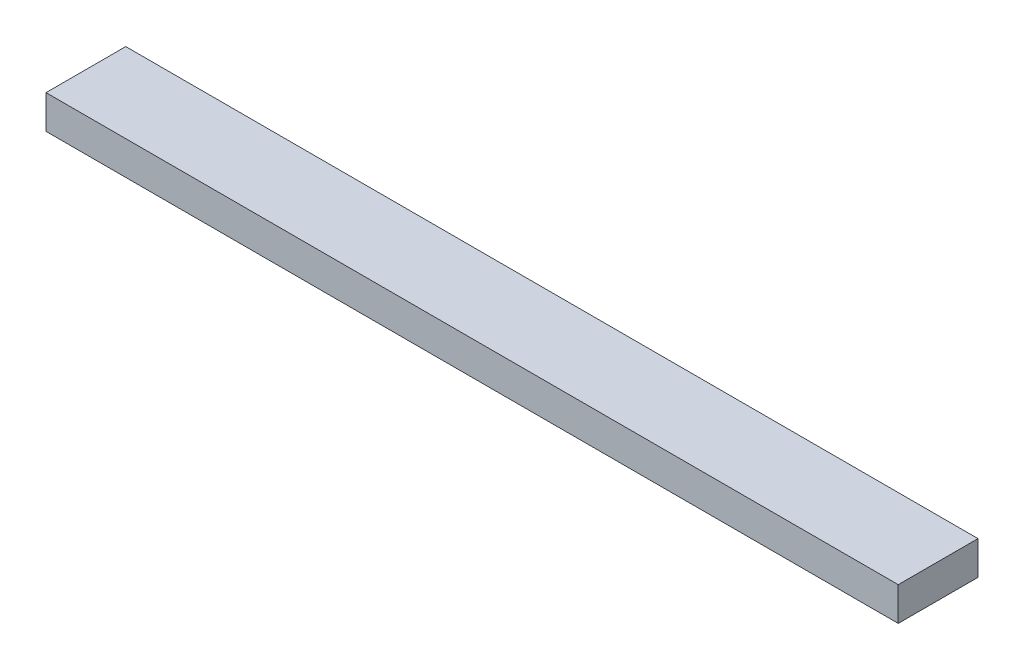
ISO-10303-21;
HEADER;
FILE_DESCRIPTION(('STEP AP214'),'2;1');
FILE_NAME('part.step','',(''),(''),'','','');
FILE_SCHEMA(('AUTOMOTIVE_DESIGN { 1 0 10303 214 1 1 1 1 }'));
ENDSEC;
DATA;
#1=APPLICATION_CONTEXT('core data for automotive mechanical design processes');
#2=APPLICATION_PROTOCOL_DEFINITION('international standard','automotive_design',2000,#1);
#3=PRODUCT_CONTEXT('',#1,'mechanical');
#4=PRODUCT('Part','Part','',(#3));
#5=PRODUCT_RELATED_PRODUCT_CATEGORY('part','',(#4));
#6=PRODUCT_DEFINITION_FORMATION('','',#4);
#7=PRODUCT_DEFINITION_CONTEXT('part definition',#1,'design');
#8=PRODUCT_DEFINITION('design','',#6,#7);
#9=PRODUCT_DEFINITION_SHAPE('','',#8);
#10=(LENGTH_UNIT() NAMED_UNIT(*) SI_UNIT(.MILLI.,.METRE.));
#11=(NAMED_UNIT(*) PLANE_ANGLE_UNIT() SI_UNIT($,.RADIAN.));
#12=(NAMED_UNIT(*) SI_UNIT($,.STERADIAN.) SOLID_ANGLE_UNIT());
#13=UNCERTAINTY_MEASURE_WITH_UNIT(LENGTH_MEASURE(1.E-05),#10,'distance_accuracy_value','');
#14=(GEOMETRIC_REPRESENTATION_CONTEXT(3) GLOBAL_UNCERTAINTY_ASSIGNED_CONTEXT((#13)) GLOBAL_UNIT_ASSIGNED_CONTEXT((#10,
#11,#12)) REPRESENTATION_CONTEXT('',''));
#15=CARTESIAN_POINT('',(0.,0.,0.));
#16=DIRECTION('',(0.,0.,1.));
#17=DIRECTION('',(1.,0.,0.));
#18=AXIS2_PLACEMENT_3D('',#15,#16,#17);
#19=CARTESIAN_POINT('',(50.7499999999999,4.,-4.75));
#20=DIRECTION('',(-1.,0.,0.));
#21=DIRECTION('',(0.,0.,1.));
#22=AXIS2_PLACEMENT_3D('',#19,#20,#21);
#23=PLANE('',#22);
#24=DIRECTION('',(0.,0.,-1.));
#25=VECTOR('',#24,1.);
#26=CARTESIAN_POINT('',(50.7499999999999,0.,-4.75));
#27=LINE('',#26,#25);
#28=CARTESIAN_POINT('',(50.7499999999999,0.,4.75));
#29=VERTEX_POINT('',#28);
#30=CARTESIAN_POINT('',(50.7499999999999,0.,-4.75));
#31=VERTEX_POINT('',#30);
#32=EDGE_CURVE('E96',#29,#31,#27,.T.);
#33=ORIENTED_EDGE('',*,*,#32,.T.);
#34=DIRECTION('',(0.,-1.,0.));
#35=VECTOR('',#34,1.);
#36=CARTESIAN_POINT('',(50.7499999999999,4.,-4.75));
#37=LINE('',#36,#35);
#38=CARTESIAN_POINT('',(50.7499999999999,4.,-4.75));
#39=VERTEX_POINT('',#38);
#40=EDGE_CURVE('E11',#39,#31,#37,.T.);
#41=ORIENTED_EDGE('',*,*,#40,.F.);
#42=DIRECTION('',(0.,0.,-1.));
#43=VECTOR('',#42,1.);
#44=CARTESIAN_POINT('',(50.7499999999999,4.,-4.75));
#45=LINE('',#44,#43);
#46=CARTESIAN_POINT('',(50.7499999999999,4.,4.75));
#47=VERTEX_POINT('',#46);
#48=EDGE_CURVE('E84',#47,#39,#45,.T.);
#49=ORIENTED_EDGE('',*,*,#48,.F.);
#50=DIRECTION('',(0.,-1.,0.));
#51=VECTOR('',#50,1.);
#52=CARTESIAN_POINT('',(50.7499999999999,4.,4.75));
#53=LINE('',#52,#51);
#54=EDGE_CURVE('E92',#47,#29,#53,.T.);
#55=ORIENTED_EDGE('',*,*,#54,.T.);
#56=EDGE_LOOP('',(#33,#41,#49,#55));
#57=FACE_BOUND('',#56,.T.);
#58=ADVANCED_FACE('F33',(#57),#23,.F.);
#59=CARTESIAN_POINT('',(-50.7500000000001,4.,-4.75));
#60=DIRECTION('',(0.,0.,1.));
#61=DIRECTION('',(1.,0.,0.));
#62=AXIS2_PLACEMENT_3D('',#59,#60,#61);
#63=PLANE('',#62);
#64=DIRECTION('',(-1.,0.,0.));
#65=VECTOR('',#64,1.);
#66=CARTESIAN_POINT('',(-50.7500000000001,0.,-4.75));
#67=LINE('',#66,#65);
#68=CARTESIAN_POINT('',(-50.7500000000001,0.,-4.75));
#69=VERTEX_POINT('',#68);
#70=EDGE_CURVE('E88',#31,#69,#67,.T.);
#71=ORIENTED_EDGE('',*,*,#70,.T.);
#72=DIRECTION('',(0.,-1.,0.));
#73=VECTOR('',#72,1.);
#74=CARTESIAN_POINT('',(-50.7500000000001,4.,-4.75));
#75=LINE('',#74,#73);
#76=CARTESIAN_POINT('',(-50.7500000000001,4.,-4.75));
#77=VERTEX_POINT('',#76);
#78=EDGE_CURVE('E41',#77,#69,#75,.T.);
#79=ORIENTED_EDGE('',*,*,#78,.F.);
#80=DIRECTION('',(-1.,0.,0.));
#81=VECTOR('',#80,1.);
#82=CARTESIAN_POINT('',(-50.7500000000001,4.,-4.75));
#83=LINE('',#82,#81);
#84=EDGE_CURVE('E79',#39,#77,#83,.T.);
#85=ORIENTED_EDGE('',*,*,#84,.F.);
#86=ORIENTED_EDGE('',*,*,#40,.T.);
#87=EDGE_LOOP('',(#71,#79,#85,#86));
#88=FACE_BOUND('',#87,.T.);
#89=ADVANCED_FACE('F87',(#88),#63,.F.);
#90=CARTESIAN_POINT('',(-50.7500000000001,4.,-4.75));
#91=DIRECTION('',(1.,0.,0.));
#92=DIRECTION('',(0.,0.,-1.));
#93=AXIS2_PLACEMENT_3D('',#90,#91,#92);
#94=PLANE('',#93);
#95=DIRECTION('',(0.,0.,1.));
#96=VECTOR('',#95,1.);
#97=CARTESIAN_POINT('',(-50.7500000000001,0.,-4.75));
#98=LINE('',#97,#96);
#99=CARTESIAN_POINT('',(-50.7500000000001,0.,4.75));
#100=VERTEX_POINT('',#99);
#101=EDGE_CURVE('E66',#69,#100,#98,.T.);
#102=ORIENTED_EDGE('',*,*,#101,.T.);
#103=DIRECTION('',(0.,-1.,0.));
#104=VECTOR('',#103,1.);
#105=CARTESIAN_POINT('',(-50.7500000000001,4.,4.75));
#106=LINE('',#105,#104);
#107=CARTESIAN_POINT('',(-50.7500000000001,4.,4.75));
#108=VERTEX_POINT('',#107);
#109=EDGE_CURVE('E89',#108,#100,#106,.T.);
#110=ORIENTED_EDGE('',*,*,#109,.F.);
#111=DIRECTION('',(0.,0.,1.));
#112=VECTOR('',#111,1.);
#113=CARTESIAN_POINT('',(-50.7500000000001,4.,-4.75));
#114=LINE('',#113,#112);
#115=EDGE_CURVE('E82',#77,#108,#114,.T.);
#116=ORIENTED_EDGE('',*,*,#115,.F.);
#117=ORIENTED_EDGE('',*,*,#78,.T.);
#118=EDGE_LOOP('',(#102,#110,#116,#117));
#119=FACE_BOUND('',#118,.T.);
#120=ADVANCED_FACE('F90',(#119),#94,.F.);
#121=CARTESIAN_POINT('',(-50.7500000000001,4.,4.75));
#122=DIRECTION('',(0.,0.,-1.));
#123=DIRECTION('',(-1.,0.,0.));
#124=AXIS2_PLACEMENT_3D('',#121,#122,#123);
#125=PLANE('',#124);
#126=DIRECTION('',(1.,0.,0.));
#127=VECTOR('',#126,1.);
#128=CARTESIAN_POINT('',(-50.7500000000001,0.,4.75));
#129=LINE('',#128,#127);
#130=EDGE_CURVE('E72',#100,#29,#129,.T.);
#131=ORIENTED_EDGE('',*,*,#130,.T.);
#132=ORIENTED_EDGE('',*,*,#54,.F.);
#133=DIRECTION('',(1.,0.,0.));
#134=VECTOR('',#133,1.);
#135=CARTESIAN_POINT('',(-50.7500000000001,4.,4.75));
#136=LINE('',#135,#134);
#137=EDGE_CURVE('E49',#108,#47,#136,.T.);
#138=ORIENTED_EDGE('',*,*,#137,.F.);
#139=ORIENTED_EDGE('',*,*,#109,.T.);
#140=EDGE_LOOP('',(#131,#132,#138,#139));
#141=FACE_BOUND('',#140,.T.);
#142=ADVANCED_FACE('F103',(#141),#125,.F.);
#143=CARTESIAN_POINT('',(0.,4.,0.));
#144=DIRECTION('',(0.,1.,0.));
#145=DIRECTION('',(0.,0.,1.));
#146=AXIS2_PLACEMENT_3D('',#143,#144,#145);
#147=PLANE('',#146);
#148=ORIENTED_EDGE('',*,*,#48,.T.);
#149=ORIENTED_EDGE('',*,*,#84,.T.);
#150=ORIENTED_EDGE('',*,*,#115,.T.);
#151=ORIENTED_EDGE('',*,*,#137,.T.);
#152=EDGE_LOOP('',(#148,#149,#150,#151));
#153=FACE_BOUND('',#152,.T.);
#154=ADVANCED_FACE('F80',(#153),#147,.T.);
#155=CARTESIAN_POINT('',(0.,0.,0.));
#156=DIRECTION('',(0.,1.,0.));
#157=DIRECTION('',(0.,0.,1.));
#158=AXIS2_PLACEMENT_3D('',#155,#156,#157);
#159=PLANE('',#158);
#160=ORIENTED_EDGE('',*,*,#32,.F.);
#161=ORIENTED_EDGE('',*,*,#130,.F.);
#162=ORIENTED_EDGE('',*,*,#101,.F.);
#163=ORIENTED_EDGE('',*,*,#70,.F.);
#164=EDGE_LOOP('',(#160,#161,#162,#163));
#165=FACE_BOUND('',#164,.T.);
#166=ADVANCED_FACE('F106',(#165),#159,.F.);
#167=CLOSED_SHELL('',(#58,#89,#120,#142,#154,#166));
#168=MANIFOLD_SOLID_BREP('B2',#167);
#169=ADVANCED_BREP_SHAPE_REPRESENTATION('',(#18,#168),#14);
#170=SHAPE_DEFINITION_REPRESENTATION(#9,#169);
ENDSEC;
END-ISO-10303-21;
